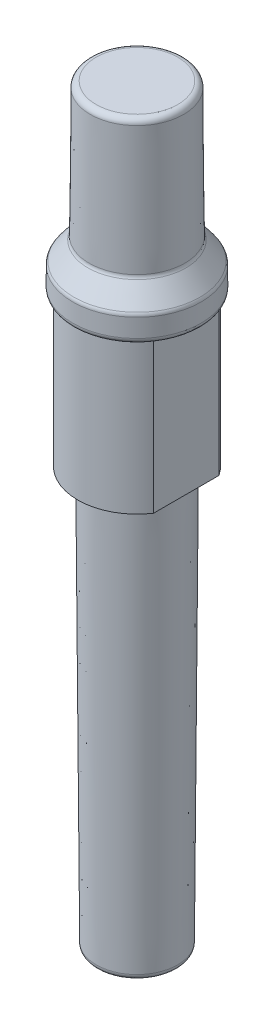
ISO-10303-21;
HEADER;
FILE_DESCRIPTION(('STEP AP214'),'2;1');
FILE_NAME('part.step','',(''),(''),'','','');
FILE_SCHEMA(('AUTOMOTIVE_DESIGN { 1 0 10303 214 1 1 1 1 }'));
ENDSEC;
DATA;
#1=APPLICATION_CONTEXT('core data for automotive mechanical design processes');
#2=APPLICATION_PROTOCOL_DEFINITION('international standard','automotive_design',2000,#1);
#3=PRODUCT_CONTEXT('',#1,'mechanical');
#4=PRODUCT('Part','Part','',(#3));
#5=PRODUCT_RELATED_PRODUCT_CATEGORY('part','',(#4));
#6=PRODUCT_DEFINITION_FORMATION('','',#4);
#7=PRODUCT_DEFINITION_CONTEXT('part definition',#1,'design');
#8=PRODUCT_DEFINITION('design','',#6,#7);
#9=PRODUCT_DEFINITION_SHAPE('','',#8);
#10=(LENGTH_UNIT() NAMED_UNIT(*) SI_UNIT(.MILLI.,.METRE.));
#11=(NAMED_UNIT(*) PLANE_ANGLE_UNIT() SI_UNIT($,.RADIAN.));
#12=(NAMED_UNIT(*) SI_UNIT($,.STERADIAN.) SOLID_ANGLE_UNIT());
#13=UNCERTAINTY_MEASURE_WITH_UNIT(LENGTH_MEASURE(1.E-05),#10,'distance_accuracy_value','');
#14=(GEOMETRIC_REPRESENTATION_CONTEXT(3) GLOBAL_UNCERTAINTY_ASSIGNED_CONTEXT((#13)) GLOBAL_UNIT_ASSIGNED_CONTEXT((#10,
#11,#12)) REPRESENTATION_CONTEXT('',''));
#15=CARTESIAN_POINT('',(0.,0.,0.));
#16=DIRECTION('',(0.,0.,1.));
#17=DIRECTION('',(1.,0.,0.));
#18=AXIS2_PLACEMENT_3D('',#15,#16,#17);
#19=CARTESIAN_POINT('',(0.,25.85,0.));
#20=DIRECTION('',(0.,1.,0.));
#21=DIRECTION('',(0.,0.,1.));
#22=AXIS2_PLACEMENT_3D('',#19,#20,#21);
#23=PLANE('',#22);
#24=DIRECTION('',(0.,0.,-1.));
#25=VECTOR('',#24,1.);
#26=CARTESIAN_POINT('',(8.5,25.85,-5.63826214360417));
#27=LINE('',#26,#25);
#28=CARTESIAN_POINT('',(8.5,25.85,5.40884691963082));
#29=VERTEX_POINT('',#28);
#30=CARTESIAN_POINT('',(8.5,25.85,-5.40884691963082));
#31=VERTEX_POINT('',#30);
#32=EDGE_CURVE('E133',#29,#31,#27,.T.);
#33=ORIENTED_EDGE('',*,*,#32,.T.);
#34=CARTESIAN_POINT('',(0.,25.85,0.));
#35=DIRECTION('',(0.,1.,0.));
#36=DIRECTION('',(0.,0.,1.));
#37=AXIS2_PLACEMENT_3D('',#34,#35,#36);
#38=CIRCLE('',#37,10.075);
#39=EDGE_CURVE('E176',#31,#29,#38,.F.);
#40=ORIENTED_EDGE('',*,*,#39,.T.);
#41=EDGE_LOOP('',(#33,#40));
#42=FACE_BOUND('',#41,.T.);
#43=ADVANCED_FACE('F51',(#42),#23,.F.);
#44=CARTESIAN_POINT('',(0.,-72.,0.));
#45=DIRECTION('',(0.,1.,0.));
#46=DIRECTION('',(0.,0.,1.));
#47=AXIS2_PLACEMENT_3D('',#44,#45,#46);
#48=PLANE('',#47);
#49=CARTESIAN_POINT('',(0.,-72.,0.));
#50=DIRECTION('',(0.,1.,0.));
#51=DIRECTION('',(0.,0.,1.));
#52=AXIS2_PLACEMENT_3D('',#49,#50,#51);
#53=CIRCLE('',#52,6.00692033208083);
#54=CARTESIAN_POINT('',(0.,-72.,6.00692033208083));
#55=VERTEX_POINT('',#54);
#56=EDGE_CURVE('E161',#55,#55,#53,.F.);
#57=ORIENTED_EDGE('',*,*,#56,.T.);
#58=EDGE_LOOP('',(#57));
#59=FACE_BOUND('',#58,.T.);
#60=ADVANCED_FACE('F248',(#59),#48,.F.);
#61=CARTESIAN_POINT('',(0.,-72.,0.));
#62=DIRECTION('',(0.,1.,0.));
#63=DIRECTION('',(0.,0.,1.));
#64=AXIS2_PLACEMENT_3D('',#61,#62,#63);
#65=CONICAL_SURFACE('',#64,7.,0.00694433281501553);
#66=CARTESIAN_POINT('',(0.,-0.993055722998681,0.));
#67=DIRECTION('',(0.,-1.,0.));
#68=DIRECTION('',(0.,0.,-1.));
#69=AXIS2_PLACEMENT_3D('',#66,#67,#68);
#70=CIRCLE('',#69,7.4931037797014);
#71=CARTESIAN_POINT('',(0.,-0.993055722998681,-7.4931037797014));
#72=VERTEX_POINT('',#71);
#73=EDGE_CURVE('E157',#72,#72,#70,.T.);
#74=ORIENTED_EDGE('',*,*,#73,.T.);
#75=EDGE_LOOP('',(#74));
#76=FACE_BOUND('',#75,.T.);
#77=CARTESIAN_POINT('',(0.,-71.0069442770015,0.));
#78=DIRECTION('',(0.,1.,0.));
#79=DIRECTION('',(0.,0.,1.));
#80=AXIS2_PLACEMENT_3D('',#77,#78,#79);
#81=CIRCLE('',#80,7.0068962202986);
#82=CARTESIAN_POINT('',(0.,-71.0069442770015,7.0068962202986));
#83=VERTEX_POINT('',#82);
#84=EDGE_CURVE('E153',#83,#83,#81,.T.);
#85=ORIENTED_EDGE('',*,*,#84,.T.);
#86=EDGE_LOOP('',(#85));
#87=FACE_BOUND('',#86,.T.);
#88=ADVANCED_FACE('F245',(#76,#87),#65,.T.);
#89=CARTESIAN_POINT('',(0.,0.,0.));
#90=DIRECTION('',(0.,1.,0.));
#91=DIRECTION('',(0.,0.,1.));
#92=AXIS2_PLACEMENT_3D('',#89,#90,#91);
#93=PLANE('',#92);
#94=CARTESIAN_POINT('',(0.,0.,0.));
#95=DIRECTION('',(0.,1.,0.));
#96=DIRECTION('',(0.,0.,1.));
#97=AXIS2_PLACEMENT_3D('',#94,#95,#96);
#98=CIRCLE('',#97,8.49307966791917);
#99=CARTESIAN_POINT('',(0.,0.,8.49307966791917));
#100=VERTEX_POINT('',#99);
#101=EDGE_CURVE('E126',#100,#100,#98,.T.);
#102=ORIENTED_EDGE('',*,*,#101,.T.);
#103=EDGE_LOOP('',(#102));
#104=FACE_BOUND('',#103,.T.);
#105=CARTESIAN_POINT('',(0.,0.,0.));
#106=DIRECTION('',(0.,1.,0.));
#107=DIRECTION('',(0.,0.,1.));
#108=AXIS2_PLACEMENT_3D('',#105,#106,#107);
#109=CIRCLE('',#108,10.2);
#110=CARTESIAN_POINT('',(8.5,0.,-5.63826214360417));
#111=VERTEX_POINT('',#110);
#112=CARTESIAN_POINT('',(-8.5,0.,-5.63826214360417));
#113=VERTEX_POINT('',#112);
#114=EDGE_CURVE('E114',#111,#113,#109,.T.);
#115=ORIENTED_EDGE('',*,*,#114,.F.);
#116=DIRECTION('',(0.,0.,-1.));
#117=VECTOR('',#116,1.);
#118=CARTESIAN_POINT('',(8.5,0.,-5.63826214360417));
#119=LINE('',#118,#117);
#120=CARTESIAN_POINT('',(8.5,0.,5.63826214360417));
#121=VERTEX_POINT('',#120);
#122=EDGE_CURVE('E138',#121,#111,#119,.T.);
#123=ORIENTED_EDGE('',*,*,#122,.F.);
#124=CARTESIAN_POINT('',(0.,0.,0.));
#125=DIRECTION('',(0.,1.,0.));
#126=DIRECTION('',(0.,0.,1.));
#127=AXIS2_PLACEMENT_3D('',#124,#125,#126);
#128=CIRCLE('',#127,10.2);
#129=CARTESIAN_POINT('',(-8.5,0.,5.63826214360417));
#130=VERTEX_POINT('',#129);
#131=EDGE_CURVE('E115',#130,#121,#128,.T.);
#132=ORIENTED_EDGE('',*,*,#131,.F.);
#133=DIRECTION('',(0.,0.,1.));
#134=VECTOR('',#133,1.);
#135=CARTESIAN_POINT('',(-8.5,0.,-5.63826214360417));
#136=LINE('',#135,#134);
#137=EDGE_CURVE('E111',#113,#130,#136,.T.);
#138=ORIENTED_EDGE('',*,*,#137,.F.);
#139=EDGE_LOOP('',(#115,#123,#132,#138));
#140=FACE_BOUND('',#139,.T.);
#141=ADVANCED_FACE('F112',(#104,#140),#93,.F.);
#142=CARTESIAN_POINT('',(0.,25.85,0.));
#143=DIRECTION('',(0.,-1.,0.));
#144=DIRECTION('',(0.,0.,-1.));
#145=AXIS2_PLACEMENT_3D('',#142,#143,#144);
#146=CYLINDRICAL_SURFACE('',#145,10.2);
#147=ORIENTED_EDGE('',*,*,#114,.T.);
#148=DIRECTION('',(0.,-1.,0.));
#149=VECTOR('',#148,1.);
#150=CARTESIAN_POINT('',(-8.5,25.85,-5.63826214360417));
#151=LINE('',#150,#149);
#152=CARTESIAN_POINT('',(-8.5,25.8578432583508,-5.63826214360417));
#153=VERTEX_POINT('',#152);
#154=EDGE_CURVE('E79',#153,#113,#151,.T.);
#155=ORIENTED_EDGE('',*,*,#154,.F.);
#156=CARTESIAN_POINT('',(0.,25.8578432583508,0.));
#157=DIRECTION('',(0.,1.,0.));
#158=DIRECTION('',(0.,0.,1.));
#159=AXIS2_PLACEMENT_3D('',#156,#157,#158);
#160=CIRCLE('',#159,10.2);
#161=CARTESIAN_POINT('',(8.5,25.8578432583508,-5.63826214360417));
#162=VERTEX_POINT('',#161);
#163=EDGE_CURVE('E66',#153,#162,#160,.F.);
#164=ORIENTED_EDGE('',*,*,#163,.T.);
#165=DIRECTION('',(0.,-1.,0.));
#166=VECTOR('',#165,1.);
#167=CARTESIAN_POINT('',(8.5,25.85,-5.63826214360417));
#168=LINE('',#167,#166);
#169=EDGE_CURVE('E72',#162,#111,#168,.T.);
#170=ORIENTED_EDGE('',*,*,#169,.T.);
#171=EDGE_LOOP('',(#147,#155,#164,#170));
#172=FACE_BOUND('',#171,.T.);
#173=ADVANCED_FACE('F129',(#172),#146,.T.);
#174=CARTESIAN_POINT('',(-8.5,25.85,-5.63826214360417));
#175=DIRECTION('',(1.,0.,0.));
#176=DIRECTION('',(0.,0.,-1.));
#177=AXIS2_PLACEMENT_3D('',#174,#175,#176);
#178=PLANE('',#177);
#179=ORIENTED_EDGE('',*,*,#137,.T.);
#180=DIRECTION('',(0.,-1.,0.));
#181=VECTOR('',#180,1.);
#182=CARTESIAN_POINT('',(-8.5,25.85,5.63826214360417));
#183=LINE('',#182,#181);
#184=CARTESIAN_POINT('',(-8.5,25.8578432583508,5.63826214360417));
#185=VERTEX_POINT('',#184);
#186=EDGE_CURVE('E127',#185,#130,#183,.T.);
#187=ORIENTED_EDGE('',*,*,#186,.F.);
#188=CARTESIAN_POINT('',(-8.5,25.8578432583508,5.63826214360417));
#189=CARTESIAN_POINT('',(-8.5,25.8552075336492,5.60007152743461));
#190=CARTESIAN_POINT('',(-8.5,25.8532360664816,5.56185820164729));
#191=CARTESIAN_POINT('',(-8.5,25.8506216584658,5.48538645993192));
#192=CARTESIAN_POINT('',(-8.5,25.849978706183,5.44712804439479));
#193=CARTESIAN_POINT('',(-8.5,25.85,5.40884691963082));
#194=B_SPLINE_CURVE_WITH_KNOTS('',3,(#188,#189,#190,#191,#192,#193),.UNSPECIFIED.,.F.,.F.,(4,2,
4),(0.,0.114792441191428,0.229583894372594),.UNSPECIFIED.);
#195=CARTESIAN_POINT('',(-8.5,25.85,5.40884691963082));
#196=VERTEX_POINT('',#195);
#197=EDGE_CURVE('E226',#185,#196,#194,.T.);
#198=ORIENTED_EDGE('',*,*,#197,.T.);
#199=DIRECTION('',(0.,0.,1.));
#200=VECTOR('',#199,1.);
#201=CARTESIAN_POINT('',(-8.5,25.85,-5.63826214360417));
#202=LINE('',#201,#200);
#203=CARTESIAN_POINT('',(-8.5,25.85,-5.40884691963082));
#204=VERTEX_POINT('',#203);
#205=EDGE_CURVE('E141',#204,#196,#202,.T.);
#206=ORIENTED_EDGE('',*,*,#205,.F.);
#207=CARTESIAN_POINT('',(-8.5,25.85,-5.40884691963082));
#208=CARTESIAN_POINT('',(-8.5,25.849978706183,-5.44712804439479));
#209=CARTESIAN_POINT('',(-8.5,25.8506216584658,-5.48538645993192));
#210=CARTESIAN_POINT('',(-8.5,25.8532360664816,-5.56185820164729));
#211=CARTESIAN_POINT('',(-8.5,25.8552075336492,-5.60007152743461));
#212=CARTESIAN_POINT('',(-8.5,25.8578432583508,-5.63826214360417));
#213=B_SPLINE_CURVE_WITH_KNOTS('',3,(#207,#208,#209,#210,#211,#212),.UNSPECIFIED.,.F.,.F.,(4,2,
4),(0.,0.114791453181166,0.229583894372594),.UNSPECIFIED.);
#214=EDGE_CURVE('E123',#204,#153,#213,.T.);
#215=ORIENTED_EDGE('',*,*,#214,.T.);
#216=ORIENTED_EDGE('',*,*,#154,.T.);
#217=EDGE_LOOP('',(#179,#187,#198,#206,#215,#216));
#218=FACE_BOUND('',#217,.T.);
#219=ADVANCED_FACE('F120',(#218),#178,.F.);
#220=CARTESIAN_POINT('',(0.,25.85,0.));
#221=DIRECTION('',(0.,-1.,0.));
#222=DIRECTION('',(0.,0.,-1.));
#223=AXIS2_PLACEMENT_3D('',#220,#221,#222);
#224=CYLINDRICAL_SURFACE('',#223,10.2);
#225=ORIENTED_EDGE('',*,*,#131,.T.);
#226=DIRECTION('',(0.,-1.,0.));
#227=VECTOR('',#226,1.);
#228=CARTESIAN_POINT('',(8.5,25.85,5.63826214360417));
#229=LINE('',#228,#227);
#230=CARTESIAN_POINT('',(8.5,25.8578432583508,5.63826214360417));
#231=VERTEX_POINT('',#230);
#232=EDGE_CURVE('E144',#231,#121,#229,.T.);
#233=ORIENTED_EDGE('',*,*,#232,.F.);
#234=CARTESIAN_POINT('',(0.,25.8578432583508,0.));
#235=DIRECTION('',(0.,1.,0.));
#236=DIRECTION('',(0.,0.,1.));
#237=AXIS2_PLACEMENT_3D('',#234,#235,#236);
#238=CIRCLE('',#237,10.2);
#239=EDGE_CURVE('E208',#231,#185,#238,.F.);
#240=ORIENTED_EDGE('',*,*,#239,.T.);
#241=ORIENTED_EDGE('',*,*,#186,.T.);
#242=EDGE_LOOP('',(#225,#233,#240,#241));
#243=FACE_BOUND('',#242,.T.);
#244=ADVANCED_FACE('F241',(#243),#224,.T.);
#245=CARTESIAN_POINT('',(8.5,25.85,-5.63826214360417));
#246=DIRECTION('',(-1.,0.,0.));
#247=DIRECTION('',(0.,0.,1.));
#248=AXIS2_PLACEMENT_3D('',#245,#246,#247);
#249=PLANE('',#248);
#250=ORIENTED_EDGE('',*,*,#122,.T.);
#251=ORIENTED_EDGE('',*,*,#169,.F.);
#252=CARTESIAN_POINT('',(8.5,25.8578432583508,-5.63826214360417));
#253=CARTESIAN_POINT('',(8.5,25.8552075336492,-5.60007152743461));
#254=CARTESIAN_POINT('',(8.5,25.8532360664816,-5.56185820164729));
#255=CARTESIAN_POINT('',(8.5,25.8506216584658,-5.48538645993192));
#256=CARTESIAN_POINT('',(8.5,25.849978706183,-5.44712804439479));
#257=CARTESIAN_POINT('',(8.5,25.85,-5.40884691963082));
#258=B_SPLINE_CURVE_WITH_KNOTS('',3,(#252,#253,#254,#255,#256,#257),.UNSPECIFIED.,.F.,.F.,(4,2,
4),(0.,0.114792441191428,0.229583894372594),.UNSPECIFIED.);
#259=EDGE_CURVE('E12',#162,#31,#258,.T.);
#260=ORIENTED_EDGE('',*,*,#259,.T.);
#261=ORIENTED_EDGE('',*,*,#32,.F.);
#262=CARTESIAN_POINT('',(8.5,25.85,5.40884691963082));
#263=CARTESIAN_POINT('',(8.5,25.849978706183,5.44712804439479));
#264=CARTESIAN_POINT('',(8.5,25.8506216584658,5.48538645993192));
#265=CARTESIAN_POINT('',(8.5,25.8532360664816,5.56185820164728));
#266=CARTESIAN_POINT('',(8.5,25.8552075336492,5.60007152743461));
#267=CARTESIAN_POINT('',(8.5,25.8578432583508,5.63826214360417));
#268=B_SPLINE_CURVE_WITH_KNOTS('',3,(#262,#263,#264,#265,#266,#267),.UNSPECIFIED.,.F.,.F.,(4,2,
4),(0.,0.114791453181164,0.229583894372592),.UNSPECIFIED.);
#269=EDGE_CURVE('E200',#29,#231,#268,.T.);
#270=ORIENTED_EDGE('',*,*,#269,.T.);
#271=ORIENTED_EDGE('',*,*,#232,.T.);
#272=EDGE_LOOP('',(#250,#251,#260,#261,#270,#271));
#273=FACE_BOUND('',#272,.T.);
#274=ADVANCED_FACE('F210',(#273),#249,.F.);
#275=ORIENTED_EDGE('',*,*,#205,.T.);
#276=CARTESIAN_POINT('',(0.,25.85,0.));
#277=DIRECTION('',(0.,1.,0.));
#278=DIRECTION('',(0.,0.,1.));
#279=AXIS2_PLACEMENT_3D('',#276,#277,#278);
#280=CIRCLE('',#279,10.075);
#281=EDGE_CURVE('E173',#196,#204,#280,.F.);
#282=ORIENTED_EDGE('',*,*,#281,.T.);
#283=EDGE_LOOP('',(#275,#282));
#284=FACE_BOUND('',#283,.T.);
#285=ADVANCED_FACE('F269',(#284),#23,.F.);
#286=CARTESIAN_POINT('',(0.,57.49,0.));
#287=DIRECTION('',(0.,1.,0.));
#288=DIRECTION('',(0.,0.,1.));
#289=AXIS2_PLACEMENT_3D('',#286,#287,#288);
#290=CYLINDRICAL_SURFACE('',#289,11.075);
#291=CARTESIAN_POINT('',(0.,26.85,0.));
#292=DIRECTION('',(0.,1.,0.));
#293=DIRECTION('',(0.,0.,1.));
#294=AXIS2_PLACEMENT_3D('',#291,#292,#293);
#295=CIRCLE('',#294,11.075);
#296=CARTESIAN_POINT('',(0.,26.85,11.075));
#297=VERTEX_POINT('',#296);
#298=EDGE_CURVE('E169',#297,#297,#295,.T.);
#299=ORIENTED_EDGE('',*,*,#298,.T.);
#300=EDGE_LOOP('',(#299));
#301=FACE_BOUND('',#300,.T.);
#302=CARTESIAN_POINT('',(0.,30.0118860690107,0.));
#303=DIRECTION('',(0.,-1.,0.));
#304=DIRECTION('',(0.,0.,-1.));
#305=AXIS2_PLACEMENT_3D('',#302,#303,#304);
#306=CIRCLE('',#305,11.075);
#307=CARTESIAN_POINT('',(0.,30.0118860690107,-11.075));
#308=VERTEX_POINT('',#307);
#309=EDGE_CURVE('E165',#308,#308,#306,.T.);
#310=ORIENTED_EDGE('',*,*,#309,.T.);
#311=EDGE_LOOP('',(#310));
#312=FACE_BOUND('',#311,.T.);
#313=ADVANCED_FACE('F275',(#301,#312),#290,.T.);
#314=CARTESIAN_POINT('',(0.,30.35,0.));
#315=DIRECTION('',(0.,-1.,0.));
#316=DIRECTION('',(0.,0.,-1.));
#317=AXIS2_PLACEMENT_3D('',#314,#315,#316);
#318=CONICAL_SURFACE('',#317,11.075,0.652093808156416);
#319=CARTESIAN_POINT('',(0.,30.6187379937015,0.));
#320=DIRECTION('',(0.,1.,0.));
#321=DIRECTION('',(0.,0.,1.));
#322=AXIS2_PLACEMENT_3D('',#319,#320,#321);
#323=CIRCLE('',#322,10.8698149102144);
#324=CARTESIAN_POINT('',(0.,30.6187379937015,10.8698149102144));
#325=VERTEX_POINT('',#324);
#326=EDGE_CURVE('E184',#325,#325,#323,.T.);
#327=ORIENTED_EDGE('',*,*,#326,.T.);
#328=EDGE_LOOP('',(#327));
#329=FACE_BOUND('',#328,.T.);
#330=CARTESIAN_POINT('',(0.,33.7851208413809,0.));
#331=DIRECTION('',(0.,-1.,0.));
#332=DIRECTION('',(0.,0.,-1.));
#333=AXIS2_PLACEMENT_3D('',#330,#331,#332);
#334=CIRCLE('',#333,8.45223881705378);
#335=CARTESIAN_POINT('',(0.,33.7851208413809,-8.45223881705378));
#336=VERTEX_POINT('',#335);
#337=EDGE_CURVE('E180',#336,#336,#334,.T.);
#338=ORIENTED_EDGE('',*,*,#337,.T.);
#339=EDGE_LOOP('',(#338));
#340=FACE_BOUND('',#339,.T.);
#341=ADVANCED_FACE('F281',(#329,#340),#318,.T.);
#342=CARTESIAN_POINT('',(0.,34.05,0.));
#343=DIRECTION('',(0.,-1.,0.));
#344=DIRECTION('',(0.,0.,-1.));
#345=AXIS2_PLACEMENT_3D('',#342,#343,#344);
#346=CONICAL_SURFACE('',#345,8.25,0.00872664625996451);
#347=CARTESIAN_POINT('',(0.,34.3832462305733,0.));
#348=DIRECTION('',(0.,-1.,0.));
#349=DIRECTION('',(0.,0.,-1.));
#350=AXIS2_PLACEMENT_3D('',#347,#348,#349);
#351=CIRCLE('',#350,8.24709180420402);
#352=CARTESIAN_POINT('',(0.,34.3832462305733,-8.24709180420402));
#353=VERTEX_POINT('',#352);
#354=EDGE_CURVE('E192',#353,#353,#351,.F.);
#355=ORIENTED_EDGE('',*,*,#354,.T.);
#356=EDGE_LOOP('',(#355));
#357=FACE_BOUND('',#356,.T.);
#358=CARTESIAN_POINT('',(0.,56.4987265354983,0.));
#359=DIRECTION('',(0.,1.,0.));
#360=DIRECTION('',(0.,0.,1.));
#361=AXIS2_PLACEMENT_3D('',#358,#359,#360);
#362=CIRCLE('',#361,8.05409293145397);
#363=CARTESIAN_POINT('',(0.,56.4987265354983,8.05409293145397));
#364=VERTEX_POINT('',#363);
#365=EDGE_CURVE('E188',#364,#364,#362,.F.);
#366=ORIENTED_EDGE('',*,*,#365,.T.);
#367=EDGE_LOOP('',(#366));
#368=FACE_BOUND('',#367,.T.);
#369=ADVANCED_FACE('F261',(#357,#368),#346,.T.);
#370=CARTESIAN_POINT('',(0.,57.49,-8.04544221898478));
#371=DIRECTION('',(0.,-1.,0.));
#372=DIRECTION('',(0.,0.,-1.));
#373=AXIS2_PLACEMENT_3D('',#370,#371,#372);
#374=PLANE('',#373);
#375=CARTESIAN_POINT('',(0.,57.49,0.));
#376=DIRECTION('',(0.,-1.,0.));
#377=DIRECTION('',(0.,0.,-1.));
#378=AXIS2_PLACEMENT_3D('',#375,#376,#377);
#379=CIRCLE('',#378,7.0541310083898);
#380=CARTESIAN_POINT('',(0.,57.49,-7.0541310083898));
#381=VERTEX_POINT('',#380);
#382=EDGE_CURVE('E196',#381,#381,#379,.F.);
#383=ORIENTED_EDGE('',*,*,#382,.T.);
#384=EDGE_LOOP('',(#383));
#385=FACE_BOUND('',#384,.T.);
#386=ADVANCED_FACE('F254',(#385),#374,.F.);
#387=CARTESIAN_POINT('',(0.,-1.,0.));
#388=DIRECTION('',(0.,1.,0.));
#389=DIRECTION('',(0.,0.,1.));
#390=AXIS2_PLACEMENT_3D('',#387,#388,#389);
#391=TOROIDAL_SURFACE('',#390,8.49307966791917,1.);
#392=ORIENTED_EDGE('',*,*,#73,.F.);
#393=EDGE_LOOP('',(#392));
#394=FACE_BOUND('',#393,.T.);
#395=ORIENTED_EDGE('',*,*,#101,.F.);
#396=EDGE_LOOP('',(#395));
#397=FACE_BOUND('',#396,.T.);
#398=ADVANCED_FACE('F252',(#394,#397),#391,.F.);
#399=CARTESIAN_POINT('',(0.,-71.,0.));
#400=DIRECTION('',(0.,1.,0.));
#401=DIRECTION('',(0.,0.,1.));
#402=AXIS2_PLACEMENT_3D('',#399,#400,#401);
#403=TOROIDAL_SURFACE('',#402,6.00692033208083,1.);
#404=ORIENTED_EDGE('',*,*,#56,.F.);
#405=EDGE_LOOP('',(#404));
#406=FACE_BOUND('',#405,.T.);
#407=ORIENTED_EDGE('',*,*,#84,.F.);
#408=EDGE_LOOP('',(#407));
#409=FACE_BOUND('',#408,.T.);
#410=ADVANCED_FACE('F220',(#406,#409),#403,.T.);
#411=CARTESIAN_POINT('',(0.,26.85,0.));
#412=DIRECTION('',(0.,1.,0.));
#413=DIRECTION('',(0.,0.,1.));
#414=AXIS2_PLACEMENT_3D('',#411,#412,#413);
#415=TOROIDAL_SURFACE('',#414,10.075,1.);
#416=ORIENTED_EDGE('',*,*,#269,.F.);
#417=ORIENTED_EDGE('',*,*,#39,.F.);
#418=ORIENTED_EDGE('',*,*,#259,.F.);
#419=ORIENTED_EDGE('',*,*,#163,.F.);
#420=ORIENTED_EDGE('',*,*,#214,.F.);
#421=ORIENTED_EDGE('',*,*,#281,.F.);
#422=ORIENTED_EDGE('',*,*,#197,.F.);
#423=ORIENTED_EDGE('',*,*,#239,.F.);
#424=EDGE_LOOP('',(#416,#417,#418,#419,#420,#421,#422,#423));
#425=FACE_BOUND('',#424,.T.);
#426=ORIENTED_EDGE('',*,*,#298,.F.);
#427=EDGE_LOOP('',(#426));
#428=FACE_BOUND('',#427,.T.);
#429=ADVANCED_FACE('F214',(#425,#428),#415,.T.);
#430=CARTESIAN_POINT('',(0.,30.0118860690107,0.));
#431=DIRECTION('',(0.,-1.,0.));
#432=DIRECTION('',(0.,0.,-1.));
#433=AXIS2_PLACEMENT_3D('',#430,#431,#432);
#434=TOROIDAL_SURFACE('',#433,10.075,1.);
#435=ORIENTED_EDGE('',*,*,#309,.F.);
#436=EDGE_LOOP('',(#435));
#437=FACE_BOUND('',#436,.T.);
#438=ORIENTED_EDGE('',*,*,#326,.F.);
#439=EDGE_LOOP('',(#438));
#440=FACE_BOUND('',#439,.T.);
#441=ADVANCED_FACE('F219',(#437,#440),#434,.T.);
#442=CARTESIAN_POINT('',(0.,34.3919727660716,0.));
#443=DIRECTION('',(0.,1.,0.));
#444=DIRECTION('',(0.,0.,1.));
#445=AXIS2_PLACEMENT_3D('',#442,#443,#444);
#446=TOROIDAL_SURFACE('',#445,9.24705372726819,1.);
#447=ORIENTED_EDGE('',*,*,#337,.F.);
#448=EDGE_LOOP('',(#447));
#449=FACE_BOUND('',#448,.T.);
#450=ORIENTED_EDGE('',*,*,#354,.F.);
#451=EDGE_LOOP('',(#450));
#452=FACE_BOUND('',#451,.T.);
#453=ADVANCED_FACE('F372',(#449,#452),#446,.F.);
#454=CARTESIAN_POINT('',(0.,56.49,0.));
#455=DIRECTION('',(0.,-1.,0.));
#456=DIRECTION('',(0.,0.,-1.));
#457=AXIS2_PLACEMENT_3D('',#454,#455,#456);
#458=TOROIDAL_SURFACE('',#457,7.0541310083898,1.);
#459=ORIENTED_EDGE('',*,*,#365,.F.);
#460=EDGE_LOOP('',(#459));
#461=FACE_BOUND('',#460,.T.);
#462=ORIENTED_EDGE('',*,*,#382,.F.);
#463=EDGE_LOOP('',(#462));
#464=FACE_BOUND('',#463,.T.);
#465=ADVANCED_FACE('F53',(#461,#464),#458,.T.);
#466=CLOSED_SHELL('',(#43,#60,#88,#141,#173,#219,#244,#274,#285,#313,#341,#369,#386,#398,#410,
#429,#441,#453,#465));
#467=MANIFOLD_SOLID_BREP('B2',#466);
#468=ADVANCED_BREP_SHAPE_REPRESENTATION('',(#18,#467),#14);
#469=SHAPE_DEFINITION_REPRESENTATION(#9,#468);
ENDSEC;
END-ISO-10303-21;
